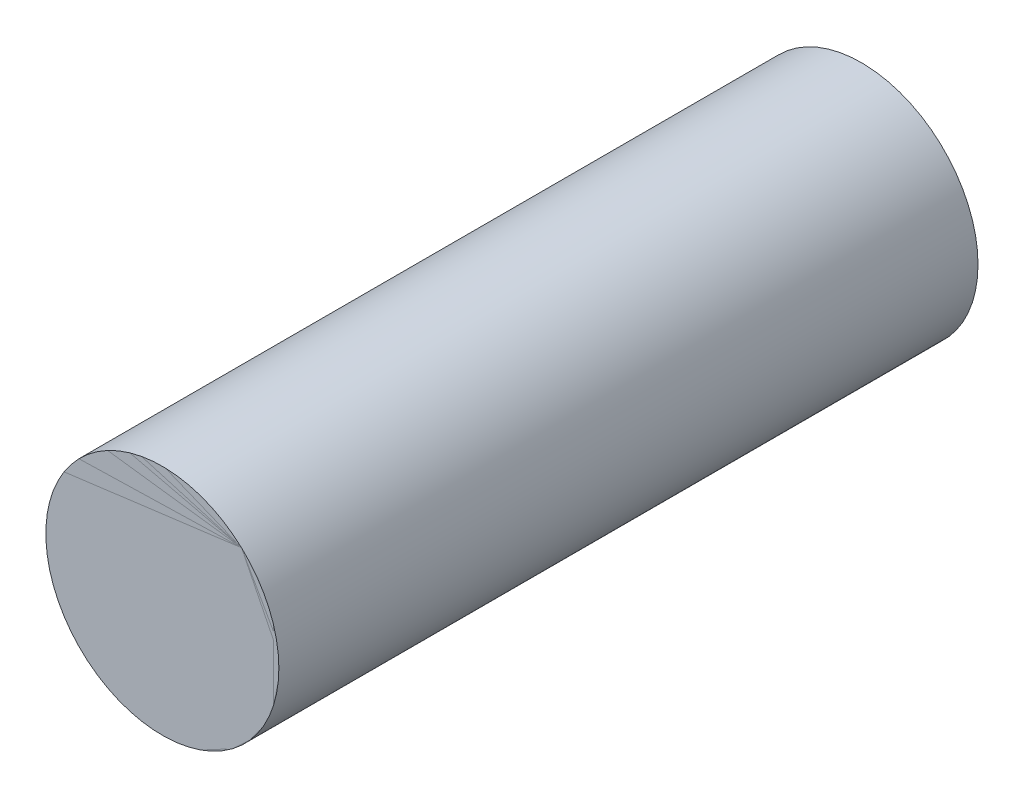
ISO-10303-21;
HEADER;
FILE_DESCRIPTION(('STEP AP214'),'2;1');
FILE_NAME('part.step','',(''),(''),'','','');
FILE_SCHEMA(('AUTOMOTIVE_DESIGN { 1 0 10303 214 1 1 1 1 }'));
ENDSEC;
DATA;
#1=APPLICATION_CONTEXT('core data for automotive mechanical design processes');
#2=APPLICATION_PROTOCOL_DEFINITION('international standard','automotive_design',2000,#1);
#3=PRODUCT_CONTEXT('',#1,'mechanical');
#4=PRODUCT('Part','Part','',(#3));
#5=PRODUCT_RELATED_PRODUCT_CATEGORY('part','',(#4));
#6=PRODUCT_DEFINITION_FORMATION('','',#4);
#7=PRODUCT_DEFINITION_CONTEXT('part definition',#1,'design');
#8=PRODUCT_DEFINITION('design','',#6,#7);
#9=PRODUCT_DEFINITION_SHAPE('','',#8);
#10=(LENGTH_UNIT() NAMED_UNIT(*) SI_UNIT(.MILLI.,.METRE.));
#11=(NAMED_UNIT(*) PLANE_ANGLE_UNIT() SI_UNIT($,.RADIAN.));
#12=(NAMED_UNIT(*) SI_UNIT($,.STERADIAN.) SOLID_ANGLE_UNIT());
#13=UNCERTAINTY_MEASURE_WITH_UNIT(LENGTH_MEASURE(1.E-05),#10,'distance_accuracy_value','');
#14=(GEOMETRIC_REPRESENTATION_CONTEXT(3) GLOBAL_UNCERTAINTY_ASSIGNED_CONTEXT((#13)) GLOBAL_UNIT_ASSIGNED_CONTEXT((#10,
#11,#12)) REPRESENTATION_CONTEXT('',''));
#15=CARTESIAN_POINT('',(0.,0.,0.));
#16=DIRECTION('',(0.,0.,1.));
#17=DIRECTION('',(1.,0.,0.));
#18=AXIS2_PLACEMENT_3D('',#15,#16,#17);
#19=CARTESIAN_POINT('',(-205.237767720353,-99.9477839792411,-11.8));
#20=DIRECTION('',(0.,0.,1.));
#21=DIRECTION('',(1.,0.,0.));
#22=AXIS2_PLACEMENT_3D('',#19,#20,#21);
#23=CYLINDRICAL_SURFACE('',#22,0.300000000000039);
#24=CARTESIAN_POINT('',(-205.237767720353,-99.9477839792411,-11.8));
#25=DIRECTION('',(0.,0.,1.));
#26=DIRECTION('',(1.,0.,0.));
#27=AXIS2_PLACEMENT_3D('',#24,#25,#26);
#28=CIRCLE('',#27,0.300000000000039);
#29=CARTESIAN_POINT('',(-204.937767720353,-99.9477839792411,-11.8));
#30=VERTEX_POINT('',#29);
#31=EDGE_CURVE('E11',#30,#30,#28,.T.);
#32=ORIENTED_EDGE('',*,*,#31,.T.);
#33=EDGE_LOOP('',(#32));
#34=FACE_BOUND('',#33,.T.);
#35=CARTESIAN_POINT('',(-205.237767720353,-99.9477839792411,-9.99999999999999));
#36=DIRECTION('',(0.,0.,1.));
#37=DIRECTION('',(1.,0.,0.));
#38=AXIS2_PLACEMENT_3D('',#35,#36,#37);
#39=CIRCLE('',#38,0.300000000000039);
#40=CARTESIAN_POINT('',(-204.937767720353,-99.9477839792411,-9.99999999999999));
#41=VERTEX_POINT('',#40);
#42=EDGE_CURVE('E46',#41,#41,#39,.T.);
#43=ORIENTED_EDGE('',*,*,#42,.F.);
#44=EDGE_LOOP('',(#43));
#45=FACE_BOUND('',#44,.T.);
#46=ADVANCED_FACE('F43',(#34,#45),#23,.T.);
#47=CARTESIAN_POINT('',(-205.237767720353,-99.9477839792411,-11.8));
#48=DIRECTION('',(0.,0.,1.));
#49=DIRECTION('',(1.,0.,0.));
#50=AXIS2_PLACEMENT_3D('',#47,#48,#49);
#51=PLANE('',#50);
#52=ORIENTED_EDGE('',*,*,#31,.F.);
#53=EDGE_LOOP('',(#52));
#54=FACE_BOUND('',#53,.T.);
#55=ADVANCED_FACE('F58',(#54),#51,.F.);
#56=CARTESIAN_POINT('',(-205.237767720353,-99.9477839792411,-9.99999999999999));
#57=DIRECTION('',(0.,0.,1.));
#58=DIRECTION('',(1.,0.,0.));
#59=AXIS2_PLACEMENT_3D('',#56,#57,#58);
#60=PLANE('',#59);
#61=ORIENTED_EDGE('',*,*,#42,.T.);
#62=EDGE_LOOP('',(#61));
#63=FACE_BOUND('',#62,.T.);
#64=ADVANCED_FACE('F55',(#63),#60,.T.);
#65=CLOSED_SHELL('',(#46,#55,#64));
#66=MANIFOLD_SOLID_BREP('B2',#65);
#67=CARTESIAN_POINT('',(-205.237767720353,-99.9477839792411,-9.99999999999999));
#68=DIRECTION('',(0.,0.,1.));
#69=DIRECTION('',(1.,0.,0.));
#70=AXIS2_PLACEMENT_3D('',#67,#68,#69);
#71=PLANE('',#70);
#72=CARTESIAN_POINT('',(-205.237767720353,-99.9477839792411,-9.99999999999999));
#73=DIRECTION('',(0.,0.,1.));
#74=DIRECTION('',(1.,0.,0.));
#75=AXIS2_PLACEMENT_3D('',#72,#73,#74);
#76=CIRCLE('',#75,0.300000000000022);
#77=CARTESIAN_POINT('',(-204.937767720353,-99.9477839792411,-9.99999999999999));
#78=VERTEX_POINT('',#77);
#79=EDGE_CURVE('E42',#78,#78,#76,.F.);
#80=ORIENTED_EDGE('',*,*,#79,.F.);
#81=EDGE_LOOP('',(#80));
#82=FACE_BOUND('',#81,.T.);
#83=ADVANCED_FACE('F83',(#82),#71,.T.);
#84=OPEN_SHELL('',(#83));
#85=SHELL_BASED_SURFACE_MODEL('B6',(#84));
#86=ADVANCED_BREP_SHAPE_REPRESENTATION('',(#18,#66),#14);
#87=MANIFOLD_SURFACE_SHAPE_REPRESENTATION('',(#18,#85),#14);
#88=SHAPE_REPRESENTATION('',(#18),#14);
#89=SHAPE_DEFINITION_REPRESENTATION(#9,#88);
#90=SHAPE_REPRESENTATION_RELATIONSHIP('','',#88,#86);
#91=SHAPE_REPRESENTATION_RELATIONSHIP('','',#88,#87);
ENDSEC;
END-ISO-10303-21;
